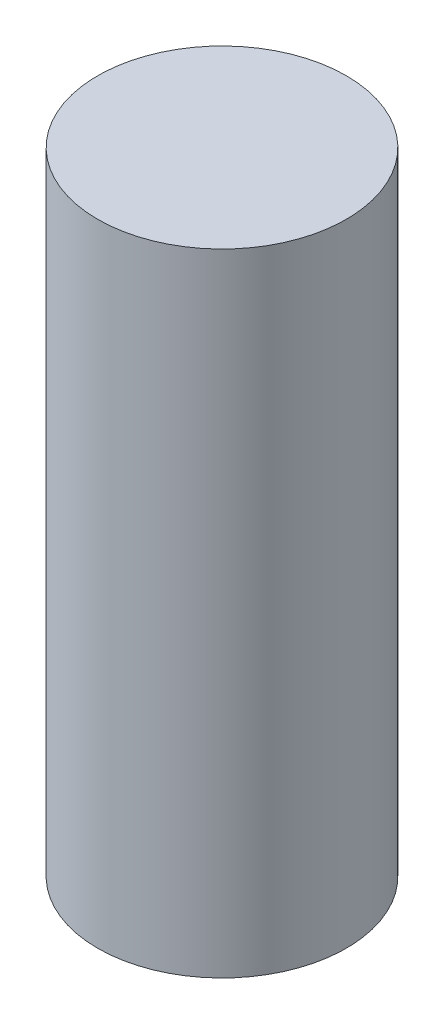
ISO-10303-21;
HEADER;
FILE_DESCRIPTION(('STEP AP214'),'2;1');
FILE_NAME('part.step','',(''),(''),'','','');
FILE_SCHEMA(('AUTOMOTIVE_DESIGN { 1 0 10303 214 1 1 1 1 }'));
ENDSEC;
DATA;
#1=APPLICATION_CONTEXT('core data for automotive mechanical design processes');
#2=APPLICATION_PROTOCOL_DEFINITION('international standard','automotive_design',2000,#1);
#3=PRODUCT_CONTEXT('',#1,'mechanical');
#4=PRODUCT('Part','Part','',(#3));
#5=PRODUCT_RELATED_PRODUCT_CATEGORY('part','',(#4));
#6=PRODUCT_DEFINITION_FORMATION('','',#4);
#7=PRODUCT_DEFINITION_CONTEXT('part definition',#1,'design');
#8=PRODUCT_DEFINITION('design','',#6,#7);
#9=PRODUCT_DEFINITION_SHAPE('','',#8);
#10=(LENGTH_UNIT() NAMED_UNIT(*) SI_UNIT(.MILLI.,.METRE.));
#11=(NAMED_UNIT(*) PLANE_ANGLE_UNIT() SI_UNIT($,.RADIAN.));
#12=(NAMED_UNIT(*) SI_UNIT($,.STERADIAN.) SOLID_ANGLE_UNIT());
#13=UNCERTAINTY_MEASURE_WITH_UNIT(LENGTH_MEASURE(1.E-05),#10,'distance_accuracy_value','');
#14=(GEOMETRIC_REPRESENTATION_CONTEXT(3) GLOBAL_UNCERTAINTY_ASSIGNED_CONTEXT((#13)) GLOBAL_UNIT_ASSIGNED_CONTEXT((#10,
#11,#12)) REPRESENTATION_CONTEXT('',''));
#15=CARTESIAN_POINT('',(0.,0.,0.));
#16=DIRECTION('',(0.,0.,1.));
#17=DIRECTION('',(1.,0.,0.));
#18=AXIS2_PLACEMENT_3D('',#15,#16,#17);
#19=CARTESIAN_POINT('',(0.,22.07514,0.));
#20=DIRECTION('',(0.,-1.,0.));
#21=DIRECTION('',(0.,0.,-1.));
#22=AXIS2_PLACEMENT_3D('',#19,#20,#21);
#23=CYLINDRICAL_SURFACE('',#22,6.35);
#24=CARTESIAN_POINT('',(0.,22.07514,0.));
#25=DIRECTION('',(0.,1.,0.));
#26=DIRECTION('',(0.,0.,1.));
#27=AXIS2_PLACEMENT_3D('',#24,#25,#26);
#28=CIRCLE('',#27,6.35);
#29=CARTESIAN_POINT('',(0.,22.07514,6.35));
#30=VERTEX_POINT('',#29);
#31=EDGE_CURVE('E11',#30,#30,#28,.T.);
#32=ORIENTED_EDGE('',*,*,#31,.F.);
#33=EDGE_LOOP('',(#32));
#34=FACE_BOUND('',#33,.T.);
#35=CARTESIAN_POINT('',(0.,-10.16,0.));
#36=DIRECTION('',(0.,-1.,0.));
#37=DIRECTION('',(0.,0.,-1.));
#38=AXIS2_PLACEMENT_3D('',#35,#36,#37);
#39=CIRCLE('',#38,6.35);
#40=CARTESIAN_POINT('',(0.,-10.16,-6.35));
#41=VERTEX_POINT('',#40);
#42=EDGE_CURVE('E42',#41,#41,#39,.T.);
#43=ORIENTED_EDGE('',*,*,#42,.F.);
#44=EDGE_LOOP('',(#43));
#45=FACE_BOUND('',#44,.T.);
#46=ADVANCED_FACE('F36',(#34,#45),#23,.T.);
#47=CARTESIAN_POINT('',(0.,22.07514,0.));
#48=DIRECTION('',(0.,1.,0.));
#49=DIRECTION('',(0.,0.,1.));
#50=AXIS2_PLACEMENT_3D('',#47,#48,#49);
#51=PLANE('',#50);
#52=ORIENTED_EDGE('',*,*,#31,.T.);
#53=EDGE_LOOP('',(#52));
#54=FACE_BOUND('',#53,.T.);
#55=ADVANCED_FACE('F65',(#54),#51,.T.);
#56=CARTESIAN_POINT('',(0.,-10.16,0.));
#57=DIRECTION('',(0.,-1.,0.));
#58=DIRECTION('',(0.,0.,-1.));
#59=AXIS2_PLACEMENT_3D('',#56,#57,#58);
#60=PLANE('',#59);
#61=CARTESIAN_POINT('',(0.,-10.16,0.));
#62=DIRECTION('',(0.,-1.,0.));
#63=DIRECTION('',(0.,0.,-1.));
#64=AXIS2_PLACEMENT_3D('',#61,#62,#63);
#65=CIRCLE('',#64,2.7051);
#66=CARTESIAN_POINT('',(0.,-10.16,-2.7051));
#67=VERTEX_POINT('',#66);
#68=EDGE_CURVE('E55',#67,#67,#65,.T.);
#69=ORIENTED_EDGE('',*,*,#68,.F.);
#70=EDGE_LOOP('',(#69));
#71=FACE_BOUND('',#70,.T.);
#72=ORIENTED_EDGE('',*,*,#42,.T.);
#73=EDGE_LOOP('',(#72));
#74=FACE_BOUND('',#73,.T.);
#75=ADVANCED_FACE('F49',(#71,#74),#60,.T.);
#76=CARTESIAN_POINT('',(0.,5.334,0.));
#77=DIRECTION('',(0.,-1.,0.));
#78=DIRECTION('',(0.,0.,-1.));
#79=AXIS2_PLACEMENT_3D('',#76,#77,#78);
#80=CONICAL_SURFACE('',#79,2.7051,1.02974425867665);
#81=CARTESIAN_POINT('',(0.,6.95938806053145,0.));
#82=VERTEX_POINT('',#81);
#83=VERTEX_LOOP('',#82);
#84=FACE_BOUND('',#83,.T.);
#85=CARTESIAN_POINT('',(0.,5.334,0.));
#86=DIRECTION('',(0.,-1.,0.));
#87=DIRECTION('',(0.,0.,-1.));
#88=AXIS2_PLACEMENT_3D('',#85,#86,#87);
#89=CIRCLE('',#88,2.7051);
#90=CARTESIAN_POINT('',(0.,5.334,-2.7051));
#91=VERTEX_POINT('',#90);
#92=EDGE_CURVE('E53',#91,#91,#89,.T.);
#93=ORIENTED_EDGE('',*,*,#92,.T.);
#94=EDGE_LOOP('',(#93));
#95=FACE_BOUND('',#94,.T.);
#96=ADVANCED_FACE('F45',(#84,#95),#80,.F.);
#97=CARTESIAN_POINT('',(0.,-10.16,0.));
#98=DIRECTION('',(0.,-1.,0.));
#99=DIRECTION('',(0.,0.,-1.));
#100=AXIS2_PLACEMENT_3D('',#97,#98,#99);
#101=CYLINDRICAL_SURFACE('',#100,2.7051);
#102=ORIENTED_EDGE('',*,*,#92,.F.);
#103=EDGE_LOOP('',(#102));
#104=FACE_BOUND('',#103,.T.);
#105=ORIENTED_EDGE('',*,*,#68,.T.);
#106=EDGE_LOOP('',(#105));
#107=FACE_BOUND('',#106,.T.);
#108=ADVANCED_FACE('F48',(#104,#107),#101,.F.);
#109=CLOSED_SHELL('',(#46,#55,#75,#96,#108));
#110=MANIFOLD_SOLID_BREP('B2',#109);
#111=ADVANCED_BREP_SHAPE_REPRESENTATION('',(#18,#110),#14);
#112=SHAPE_DEFINITION_REPRESENTATION(#9,#111);
ENDSEC;
END-ISO-10303-21;
